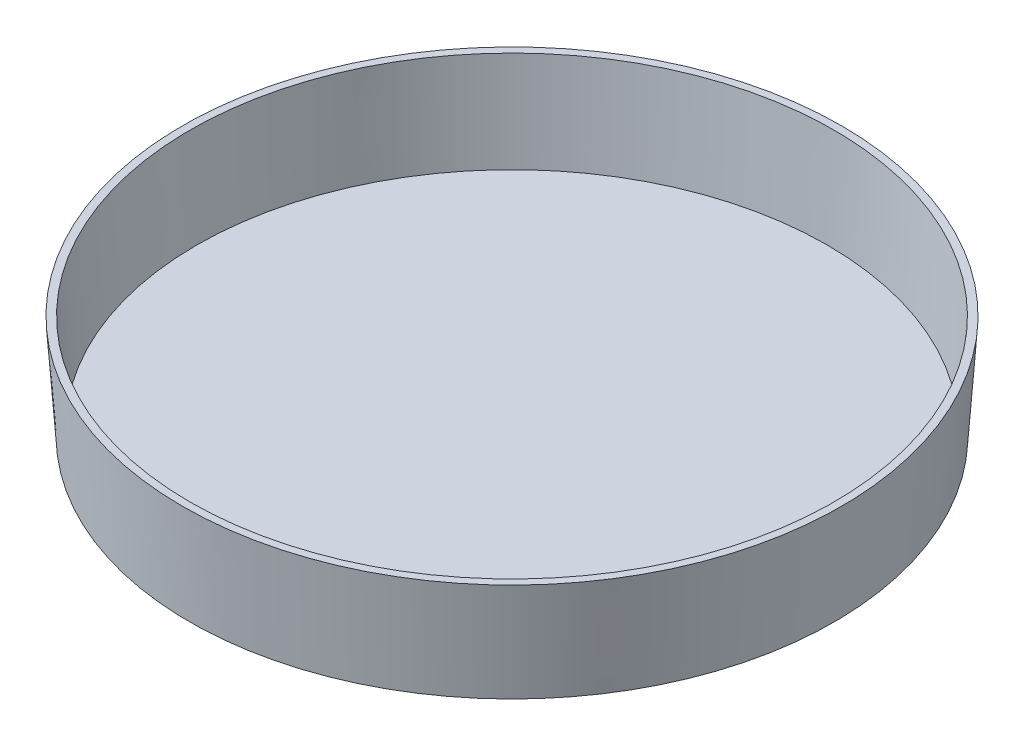
ISO-10303-21;
HEADER;
FILE_DESCRIPTION(('STEP AP214'),'2;1');
FILE_NAME('part.step','',(''),(''),'','','');
FILE_SCHEMA(('AUTOMOTIVE_DESIGN { 1 0 10303 214 1 1 1 1 }'));
ENDSEC;
DATA;
#1=APPLICATION_CONTEXT('core data for automotive mechanical design processes');
#2=APPLICATION_PROTOCOL_DEFINITION('international standard','automotive_design',2000,#1);
#3=PRODUCT_CONTEXT('',#1,'mechanical');
#4=PRODUCT('Part','Part','',(#3));
#5=PRODUCT_RELATED_PRODUCT_CATEGORY('part','',(#4));
#6=PRODUCT_DEFINITION_FORMATION('','',#4);
#7=PRODUCT_DEFINITION_CONTEXT('part definition',#1,'design');
#8=PRODUCT_DEFINITION('design','',#6,#7);
#9=PRODUCT_DEFINITION_SHAPE('','',#8);
#10=(LENGTH_UNIT() NAMED_UNIT(*) SI_UNIT(.MILLI.,.METRE.));
#11=(NAMED_UNIT(*) PLANE_ANGLE_UNIT() SI_UNIT($,.RADIAN.));
#12=(NAMED_UNIT(*) SI_UNIT($,.STERADIAN.) SOLID_ANGLE_UNIT());
#13=UNCERTAINTY_MEASURE_WITH_UNIT(LENGTH_MEASURE(1.E-05),#10,'distance_accuracy_value','');
#14=(GEOMETRIC_REPRESENTATION_CONTEXT(3) GLOBAL_UNCERTAINTY_ASSIGNED_CONTEXT((#13)) GLOBAL_UNIT_ASSIGNED_CONTEXT((#10,
#11,#12)) REPRESENTATION_CONTEXT('',''));
#15=CARTESIAN_POINT('',(0.,0.,0.));
#16=DIRECTION('',(0.,0.,1.));
#17=DIRECTION('',(1.,0.,0.));
#18=AXIS2_PLACEMENT_3D('',#15,#16,#17);
#19=CARTESIAN_POINT('',(0.,14.1224,0.));
#20=DIRECTION('',(0.,1.,0.));
#21=DIRECTION('',(0.,0.,1.));
#22=AXIS2_PLACEMENT_3D('',#19,#20,#21);
#23=PLANE('',#22);
#24=CARTESIAN_POINT('',(0.,14.1224,0.));
#25=DIRECTION('',(0.,1.,0.));
#26=DIRECTION('',(0.,0.,1.));
#27=AXIS2_PLACEMENT_3D('',#24,#25,#26);
#28=CIRCLE('',#27,43.8379671466479);
#29=CARTESIAN_POINT('',(0.,14.1224,43.8379671466479));
#30=VERTEX_POINT('',#29);
#31=EDGE_CURVE('E47',#30,#30,#28,.F.);
#32=ORIENTED_EDGE('',*,*,#31,.T.);
#33=EDGE_LOOP('',(#32));
#34=FACE_BOUND('',#33,.T.);
#35=CARTESIAN_POINT('',(0.,14.1224,0.));
#36=DIRECTION('',(0.,-1.,0.));
#37=DIRECTION('',(0.,0.,-1.));
#38=AXIS2_PLACEMENT_3D('',#35,#36,#37);
#39=CIRCLE('',#38,44.8564);
#40=CARTESIAN_POINT('',(0.,14.1224,-44.8564));
#41=VERTEX_POINT('',#40);
#42=EDGE_CURVE('E39',#41,#41,#39,.T.);
#43=ORIENTED_EDGE('',*,*,#42,.F.);
#44=EDGE_LOOP('',(#43));
#45=FACE_BOUND('',#44,.T.);
#46=ADVANCED_FACE('F33',(#34,#45),#23,.T.);
#47=CARTESIAN_POINT('',(0.,0.,0.));
#48=DIRECTION('',(0.,1.,0.));
#49=DIRECTION('',(0.,0.,1.));
#50=AXIS2_PLACEMENT_3D('',#47,#48,#49);
#51=CONICAL_SURFACE('',#50,43.8785,0.069134249925961);
#52=ORIENTED_EDGE('',*,*,#42,.T.);
#53=EDGE_LOOP('',(#52));
#54=FACE_BOUND('',#53,.T.);
#55=CARTESIAN_POINT('',(0.,0.,0.));
#56=DIRECTION('',(0.,-1.,0.));
#57=DIRECTION('',(0.,0.,-1.));
#58=AXIS2_PLACEMENT_3D('',#55,#56,#57);
#59=CIRCLE('',#58,43.8785);
#60=CARTESIAN_POINT('',(0.,0.,-43.8785));
#61=VERTEX_POINT('',#60);
#62=EDGE_CURVE('E43',#61,#61,#59,.T.);
#63=ORIENTED_EDGE('',*,*,#62,.F.);
#64=EDGE_LOOP('',(#63));
#65=FACE_BOUND('',#64,.T.);
#66=ADVANCED_FACE('F84',(#54,#65),#51,.T.);
#67=CARTESIAN_POINT('',(0.,0.,0.));
#68=DIRECTION('',(0.,-1.,0.));
#69=DIRECTION('',(0.,0.,-1.));
#70=AXIS2_PLACEMENT_3D('',#67,#68,#69);
#71=PLANE('',#70);
#72=CARTESIAN_POINT('',(0.,0.,0.));
#73=DIRECTION('',(0.,-1.,0.));
#74=DIRECTION('',(0.,0.,-1.));
#75=AXIS2_PLACEMENT_3D('',#72,#73,#74);
#76=CIRCLE('',#75,40.8305);
#77=CARTESIAN_POINT('',(0.,0.,40.8305));
#78=VERTEX_POINT('',#77);
#79=EDGE_CURVE('E56',#78,#78,#76,.T.);
#80=ORIENTED_EDGE('',*,*,#79,.F.);
#81=EDGE_LOOP('',(#80));
#82=FACE_BOUND('',#81,.T.);
#83=ORIENTED_EDGE('',*,*,#62,.T.);
#84=EDGE_LOOP('',(#83));
#85=FACE_BOUND('',#84,.T.);
#86=ADVANCED_FACE('F89',(#82,#85),#71,.T.);
#87=CARTESIAN_POINT('',(0.,0.0701844584432986,0.));
#88=DIRECTION('',(0.,1.,0.));
#89=DIRECTION('',(0.,0.,1.));
#90=AXIS2_PLACEMENT_3D('',#87,#88,#89);
#91=CONICAL_SURFACE('',#90,42.864927041702,0.069134249925961);
#92=ORIENTED_EDGE('',*,*,#31,.F.);
#93=EDGE_LOOP('',(#92));
#94=FACE_BOUND('',#93,.T.);
#95=CARTESIAN_POINT('',(0.,1.016,0.));
#96=DIRECTION('',(0.,-1.,0.));
#97=DIRECTION('',(0.,0.,-1.));
#98=AXIS2_PLACEMENT_3D('',#95,#96,#97);
#99=CIRCLE('',#98,42.9304196646335);
#100=CARTESIAN_POINT('',(0.,1.016,-42.9304196646335));
#101=VERTEX_POINT('',#100);
#102=EDGE_CURVE('E52',#101,#101,#99,.T.);
#103=ORIENTED_EDGE('',*,*,#102,.T.);
#104=EDGE_LOOP('',(#103));
#105=FACE_BOUND('',#104,.T.);
#106=ADVANCED_FACE('F79',(#94,#105),#91,.F.);
#107=CARTESIAN_POINT('',(0.,1.016,0.));
#108=DIRECTION('',(0.,-1.,0.));
#109=DIRECTION('',(0.,0.,-1.));
#110=AXIS2_PLACEMENT_3D('',#107,#108,#109);
#111=PLANE('',#110);
#112=ORIENTED_EDGE('',*,*,#102,.F.);
#113=EDGE_LOOP('',(#112));
#114=FACE_BOUND('',#113,.T.);
#115=ADVANCED_FACE('F70',(#114),#111,.F.);
#116=CARTESIAN_POINT('',(0.,-0.762,0.));
#117=DIRECTION('',(0.,-1.,0.));
#118=DIRECTION('',(0.,0.,-1.));
#119=AXIS2_PLACEMENT_3D('',#116,#117,#118);
#120=PLANE('',#119);
#121=CARTESIAN_POINT('',(0.,-0.762,0.));
#122=DIRECTION('',(0.,-1.,0.));
#123=DIRECTION('',(0.,0.,-1.));
#124=AXIS2_PLACEMENT_3D('',#121,#122,#123);
#125=CIRCLE('',#124,40.8305);
#126=CARTESIAN_POINT('',(0.,-0.762,40.8305));
#127=VERTEX_POINT('',#126);
#128=EDGE_CURVE('E55',#127,#127,#125,.T.);
#129=ORIENTED_EDGE('',*,*,#128,.T.);
#130=EDGE_LOOP('',(#129));
#131=FACE_BOUND('',#130,.T.);
#132=CARTESIAN_POINT('',(0.,-0.762,0.));
#133=DIRECTION('',(0.,-1.,0.));
#134=DIRECTION('',(0.,0.,-1.));
#135=AXIS2_PLACEMENT_3D('',#132,#133,#134);
#136=CIRCLE('',#135,40.1447);
#137=CARTESIAN_POINT('',(0.,-0.762,40.1447));
#138=VERTEX_POINT('',#137);
#139=EDGE_CURVE('E59',#138,#138,#136,.T.);
#140=ORIENTED_EDGE('',*,*,#139,.F.);
#141=EDGE_LOOP('',(#140));
#142=FACE_BOUND('',#141,.T.);
#143=ADVANCED_FACE('F67',(#131,#142),#120,.T.);
#144=CARTESIAN_POINT('',(0.,-0.762,0.));
#145=DIRECTION('',(0.,1.,0.));
#146=DIRECTION('',(0.,0.,1.));
#147=AXIS2_PLACEMENT_3D('',#144,#145,#146);
#148=CYLINDRICAL_SURFACE('',#147,40.8305);
#149=CARTESIAN_POINT('',(0.,-0.762,40.8305));
#150=CARTESIAN_POINT('',(0.,-0.7540625,40.8305));
#151=CARTESIAN_POINT('',(0.,-0.746125,40.8305));
#152=CARTESIAN_POINT('',(0.,-0.73025,40.8305));
#153=CARTESIAN_POINT('',(0.,-0.7223125,40.8305));
#154=CARTESIAN_POINT('',(0.,-0.7064375,40.8305));
#155=CARTESIAN_POINT('',(0.,-0.6985,40.8305));
#156=CARTESIAN_POINT('',(0.,-0.682625,40.8305));
#157=CARTESIAN_POINT('',(0.,-0.6746875,40.8305));
#158=CARTESIAN_POINT('',(0.,-0.6588125,40.8305));
#159=CARTESIAN_POINT('',(0.,-0.650875,40.8305));
#160=CARTESIAN_POINT('',(0.,-0.635,40.8305));
#161=CARTESIAN_POINT('',(0.,-0.6270625,40.8305));
#162=CARTESIAN_POINT('',(0.,-0.6111875,40.8305));
#163=CARTESIAN_POINT('',(0.,-0.60325,40.8305));
#164=CARTESIAN_POINT('',(0.,-0.587375,40.8305));
#165=CARTESIAN_POINT('',(0.,-0.5794375,40.8305));
#166=CARTESIAN_POINT('',(0.,-0.5635625,40.8305));
#167=CARTESIAN_POINT('',(0.,-0.555625,40.8305));
#168=CARTESIAN_POINT('',(0.,-0.53975,40.8305));
#169=CARTESIAN_POINT('',(0.,-0.5318125,40.8305));
#170=CARTESIAN_POINT('',(0.,-0.5159375,40.8305));
#171=CARTESIAN_POINT('',(0.,-0.508,40.8305));
#172=CARTESIAN_POINT('',(0.,-0.492125,40.8305));
#173=CARTESIAN_POINT('',(0.,-0.4841875,40.8305));
#174=CARTESIAN_POINT('',(0.,-0.4683125,40.8305));
#175=CARTESIAN_POINT('',(0.,-0.460375,40.8305));
#176=CARTESIAN_POINT('',(0.,-0.4445,40.8305));
#177=CARTESIAN_POINT('',(0.,-0.4365625,40.8305));
#178=CARTESIAN_POINT('',(0.,-0.4206875,40.8305));
#179=CARTESIAN_POINT('',(0.,-0.41275,40.8305));
#180=CARTESIAN_POINT('',(0.,-0.396875,40.8305));
#181=CARTESIAN_POINT('',(0.,-0.3889375,40.8305));
#182=CARTESIAN_POINT('',(0.,-0.3730625,40.8305));
#183=CARTESIAN_POINT('',(0.,-0.365125,40.8305));
#184=CARTESIAN_POINT('',(0.,-0.34925,40.8305));
#185=CARTESIAN_POINT('',(0.,-0.3413125,40.8305));
#186=CARTESIAN_POINT('',(0.,-0.3254375,40.8305));
#187=CARTESIAN_POINT('',(0.,-0.3175,40.8305));
#188=CARTESIAN_POINT('',(0.,-0.301625,40.8305));
#189=CARTESIAN_POINT('',(0.,-0.2936875,40.8305));
#190=CARTESIAN_POINT('',(0.,-0.2778125,40.8305));
#191=CARTESIAN_POINT('',(0.,-0.269875,40.8305));
#192=CARTESIAN_POINT('',(0.,-0.254,40.8305));
#193=CARTESIAN_POINT('',(0.,-0.2460625,40.8305));
#194=CARTESIAN_POINT('',(0.,-0.2301875,40.8305));
#195=CARTESIAN_POINT('',(0.,-0.22225,40.8305));
#196=CARTESIAN_POINT('',(0.,-0.206375,40.8305));
#197=CARTESIAN_POINT('',(0.,-0.1984375,40.8305));
#198=CARTESIAN_POINT('',(0.,-0.1825625,40.8305));
#199=CARTESIAN_POINT('',(0.,-0.174625,40.8305));
#200=CARTESIAN_POINT('',(0.,-0.15875,40.8305));
#201=CARTESIAN_POINT('',(0.,-0.1508125,40.8305));
#202=CARTESIAN_POINT('',(0.,-0.1349375,40.8305));
#203=CARTESIAN_POINT('',(0.,-0.127,40.8305));
#204=CARTESIAN_POINT('',(0.,-0.111125,40.8305));
#205=CARTESIAN_POINT('',(0.,-0.1031875,40.8305));
#206=CARTESIAN_POINT('',(0.,-0.0873125,40.8305));
#207=CARTESIAN_POINT('',(0.,-0.079375,40.8305));
#208=CARTESIAN_POINT('',(0.,-0.0635,40.8305));
#209=CARTESIAN_POINT('',(0.,-0.0555625,40.8305));
#210=CARTESIAN_POINT('',(0.,-0.0396875,40.8305));
#211=CARTESIAN_POINT('',(0.,-0.03175,40.8305));
#212=CARTESIAN_POINT('',(0.,-0.015875,40.8305));
#213=CARTESIAN_POINT('',(0.,-0.00793749999999999,40.8305));
#214=CARTESIAN_POINT('',(0.,0.,40.8305));
#215=B_SPLINE_CURVE_WITH_KNOTS('',3,(#149,#150,#151,#152,#153,#154,#155,#156,#157,#158,#159,
#160,#161,#162,#163,#164,#165,#166,#167,#168,#169,#170,#171,#172,#173,#174,#175,#176,#177,#178,
#179,#180,#181,#182,#183,#184,#185,#186,#187,#188,#189,#190,#191,#192,#193,#194,#195,#196,#197,
#198,#199,#200,#201,#202,#203,#204,#205,#206,#207,#208,#209,#210,#211,#212,#213,#214),
.UNSPECIFIED.,.F.,.F.,(4,2,2,2,2,2,2,2,2,2,2,2,2,2,2,2,2,2,2,2,2,2,2,2,2,2,2,2,2,2,2,2,4),(0.,
0.0238125000000001,0.047625,0.0714375,0.0952500000000001,0.1190625,0.142875,0.1666875,0.1905,
0.2143125,0.238125,0.2619375,0.28575,0.3095625,0.333375,0.3571875,0.381,0.4048125,0.428625,
0.4524375,0.47625,0.5000625,0.523875,0.5476875,0.5715,0.5953125,0.619125,0.6429375,0.66675,
0.6905625,0.714375,0.7381875,0.762),.UNSPECIFIED.);
#216=EDGE_CURVE('BSEAM69',#127,#78,#215,.T.);
#217=ORIENTED_EDGE('',*,*,#128,.F.);
#218=ORIENTED_EDGE('',*,*,#79,.T.);
#219=ORIENTED_EDGE('',*,*,#216,.T.);
#220=ORIENTED_EDGE('',*,*,#216,.F.);
#221=EDGE_LOOP('',(#217,#219,#218,#220));
#222=FACE_BOUND('',#221,.T.);
#223=ADVANCED_FACE('F69',(#222),#148,.T.);
#224=CARTESIAN_POINT('',(0.,-0.762,0.));
#225=DIRECTION('',(0.,1.,0.));
#226=DIRECTION('',(0.,0.,1.));
#227=AXIS2_PLACEMENT_3D('',#224,#225,#226);
#228=CYLINDRICAL_SURFACE('',#227,40.1447);
#229=CARTESIAN_POINT('',(0.,0.,0.));
#230=DIRECTION('',(0.,-1.,0.));
#231=DIRECTION('',(0.,0.,-1.));
#232=AXIS2_PLACEMENT_3D('',#229,#230,#231);
#233=CIRCLE('',#232,40.1447);
#234=CARTESIAN_POINT('',(0.,0.,40.1447));
#235=VERTEX_POINT('',#234);
#236=EDGE_CURVE('E10',#235,#235,#233,.F.);
#237=CARTESIAN_POINT('',(0.,-0.762,40.1447));
#238=CARTESIAN_POINT('',(0.,-0.7540625,40.1447));
#239=CARTESIAN_POINT('',(0.,-0.746125,40.1447));
#240=CARTESIAN_POINT('',(0.,-0.73025,40.1447));
#241=CARTESIAN_POINT('',(0.,-0.7223125,40.1447));
#242=CARTESIAN_POINT('',(0.,-0.7064375,40.1447));
#243=CARTESIAN_POINT('',(0.,-0.6985,40.1447));
#244=CARTESIAN_POINT('',(0.,-0.682625,40.1447));
#245=CARTESIAN_POINT('',(0.,-0.6746875,40.1447));
#246=CARTESIAN_POINT('',(0.,-0.6588125,40.1447));
#247=CARTESIAN_POINT('',(0.,-0.650875,40.1447));
#248=CARTESIAN_POINT('',(0.,-0.635,40.1447));
#249=CARTESIAN_POINT('',(0.,-0.6270625,40.1447));
#250=CARTESIAN_POINT('',(0.,-0.6111875,40.1447));
#251=CARTESIAN_POINT('',(0.,-0.60325,40.1447));
#252=CARTESIAN_POINT('',(0.,-0.587375,40.1447));
#253=CARTESIAN_POINT('',(0.,-0.5794375,40.1447));
#254=CARTESIAN_POINT('',(0.,-0.5635625,40.1447));
#255=CARTESIAN_POINT('',(0.,-0.555625,40.1447));
#256=CARTESIAN_POINT('',(0.,-0.53975,40.1447));
#257=CARTESIAN_POINT('',(0.,-0.5318125,40.1447));
#258=CARTESIAN_POINT('',(0.,-0.5159375,40.1447));
#259=CARTESIAN_POINT('',(0.,-0.508,40.1447));
#260=CARTESIAN_POINT('',(0.,-0.492125,40.1447));
#261=CARTESIAN_POINT('',(0.,-0.4841875,40.1447));
#262=CARTESIAN_POINT('',(0.,-0.4683125,40.1447));
#263=CARTESIAN_POINT('',(0.,-0.460375,40.1447));
#264=CARTESIAN_POINT('',(0.,-0.4445,40.1447));
#265=CARTESIAN_POINT('',(0.,-0.4365625,40.1447));
#266=CARTESIAN_POINT('',(0.,-0.4206875,40.1447));
#267=CARTESIAN_POINT('',(0.,-0.41275,40.1447));
#268=CARTESIAN_POINT('',(0.,-0.396875,40.1447));
#269=CARTESIAN_POINT('',(0.,-0.3889375,40.1447));
#270=CARTESIAN_POINT('',(0.,-0.3730625,40.1447));
#271=CARTESIAN_POINT('',(0.,-0.365125,40.1447));
#272=CARTESIAN_POINT('',(0.,-0.34925,40.1447));
#273=CARTESIAN_POINT('',(0.,-0.3413125,40.1447));
#274=CARTESIAN_POINT('',(0.,-0.3254375,40.1447));
#275=CARTESIAN_POINT('',(0.,-0.3175,40.1447));
#276=CARTESIAN_POINT('',(0.,-0.301625,40.1447));
#277=CARTESIAN_POINT('',(0.,-0.2936875,40.1447));
#278=CARTESIAN_POINT('',(0.,-0.2778125,40.1447));
#279=CARTESIAN_POINT('',(0.,-0.269875,40.1447));
#280=CARTESIAN_POINT('',(0.,-0.254,40.1447));
#281=CARTESIAN_POINT('',(0.,-0.2460625,40.1447));
#282=CARTESIAN_POINT('',(0.,-0.2301875,40.1447));
#283=CARTESIAN_POINT('',(0.,-0.22225,40.1447));
#284=CARTESIAN_POINT('',(0.,-0.206375,40.1447));
#285=CARTESIAN_POINT('',(0.,-0.1984375,40.1447));
#286=CARTESIAN_POINT('',(0.,-0.1825625,40.1447));
#287=CARTESIAN_POINT('',(0.,-0.174625,40.1447));
#288=CARTESIAN_POINT('',(0.,-0.15875,40.1447));
#289=CARTESIAN_POINT('',(0.,-0.1508125,40.1447));
#290=CARTESIAN_POINT('',(0.,-0.1349375,40.1447));
#291=CARTESIAN_POINT('',(0.,-0.127,40.1447));
#292=CARTESIAN_POINT('',(0.,-0.111125,40.1447));
#293=CARTESIAN_POINT('',(0.,-0.1031875,40.1447));
#294=CARTESIAN_POINT('',(0.,-0.0873125,40.1447));
#295=CARTESIAN_POINT('',(0.,-0.079375,40.1447));
#296=CARTESIAN_POINT('',(0.,-0.0635,40.1447));
#297=CARTESIAN_POINT('',(0.,-0.0555625,40.1447));
#298=CARTESIAN_POINT('',(0.,-0.0396875,40.1447));
#299=CARTESIAN_POINT('',(0.,-0.03175,40.1447));
#300=CARTESIAN_POINT('',(0.,-0.015875,40.1447));
#301=CARTESIAN_POINT('',(0.,-0.00793749999999999,40.1447));
#302=CARTESIAN_POINT('',(0.,0.,40.1447));
#303=B_SPLINE_CURVE_WITH_KNOTS('',3,(#237,#238,#239,#240,#241,#242,#243,#244,#245,#246,#247,
#248,#249,#250,#251,#252,#253,#254,#255,#256,#257,#258,#259,#260,#261,#262,#263,#264,#265,#266,
#267,#268,#269,#270,#271,#272,#273,#274,#275,#276,#277,#278,#279,#280,#281,#282,#283,#284,#285,
#286,#287,#288,#289,#290,#291,#292,#293,#294,#295,#296,#297,#298,#299,#300,#301,#302),
.UNSPECIFIED.,.F.,.F.,(4,2,2,2,2,2,2,2,2,2,2,2,2,2,2,2,2,2,2,2,2,2,2,2,2,2,2,2,2,2,2,2,4),(0.,
0.0238125000000001,0.047625,0.0714375,0.0952500000000001,0.1190625,0.142875,0.1666875,0.1905,
0.2143125,0.238125,0.2619375,0.28575,0.3095625,0.333375,0.3571875,0.381,0.4048125,0.428625,
0.4524375,0.47625,0.5000625,0.523875,0.5476875,0.5715,0.5953125,0.619125,0.6429375,0.66675,
0.6905625,0.714375,0.7381875,0.762),.UNSPECIFIED.);
#304=EDGE_CURVE('BSEAM65',#138,#235,#303,.T.);
#305=ORIENTED_EDGE('',*,*,#139,.T.);
#306=ORIENTED_EDGE('',*,*,#236,.T.);
#307=ORIENTED_EDGE('',*,*,#304,.T.);
#308=ORIENTED_EDGE('',*,*,#304,.F.);
#309=EDGE_LOOP('',(#305,#307,#306,#308));
#310=FACE_BOUND('',#309,.T.);
#311=ADVANCED_FACE('F65',(#310),#228,.F.);
#312=ORIENTED_EDGE('',*,*,#236,.F.);
#313=EDGE_LOOP('',(#312));
#314=FACE_BOUND('',#313,.T.);
#315=ADVANCED_FACE('F102',(#314),#71,.T.);
#316=CLOSED_SHELL('',(#46,#66,#86,#106,#115,#143,#223,#311,#315));
#317=MANIFOLD_SOLID_BREP('B2',#316);
#318=ADVANCED_BREP_SHAPE_REPRESENTATION('',(#18,#317),#14);
#319=SHAPE_DEFINITION_REPRESENTATION(#9,#318);
ENDSEC;
END-ISO-10303-21;
